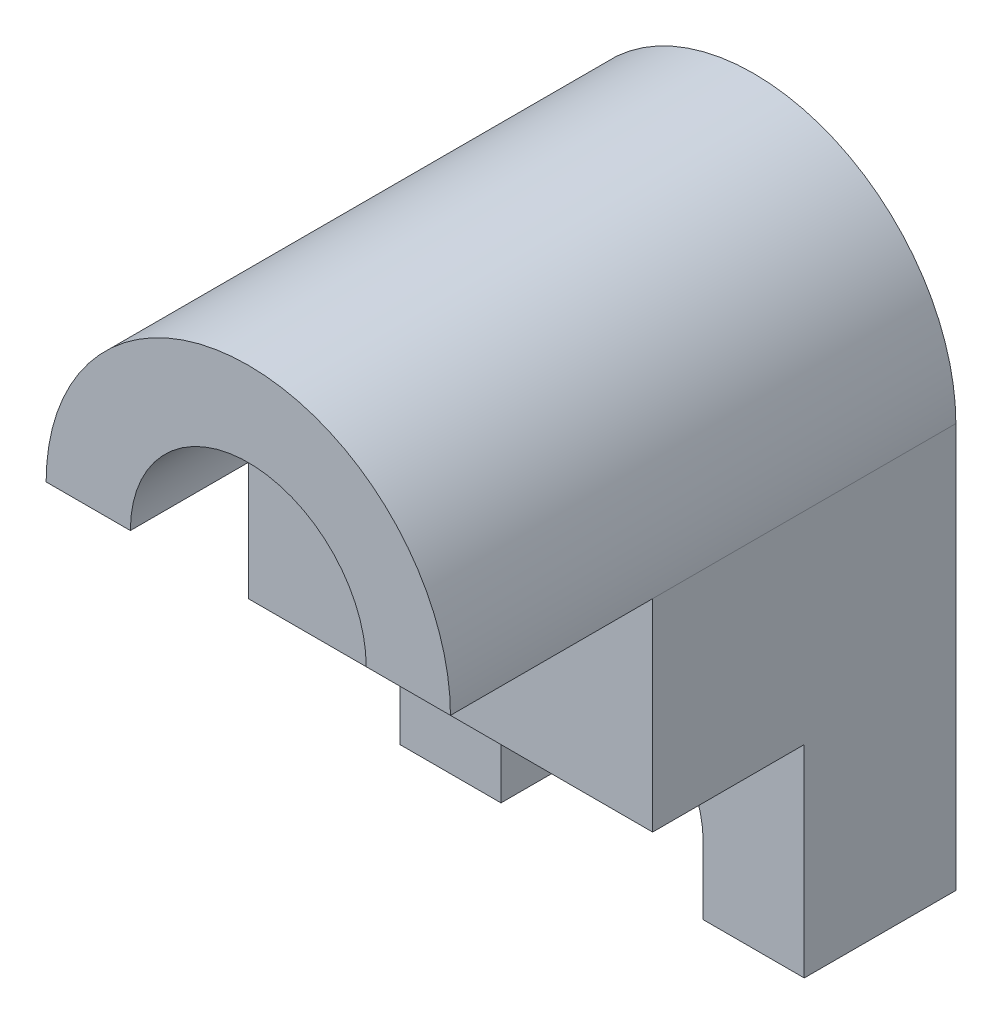
ISO-10303-21;
HEADER;
FILE_DESCRIPTION(('STEP AP214'),'2;1');
FILE_NAME('part.step','',(''),(''),'','','');
FILE_SCHEMA(('AUTOMOTIVE_DESIGN { 1 0 10303 214 1 1 1 1 }'));
ENDSEC;
DATA;
#1=APPLICATION_CONTEXT('core data for automotive mechanical design processes');
#2=APPLICATION_PROTOCOL_DEFINITION('international standard','automotive_design',2000,#1);
#3=PRODUCT_CONTEXT('',#1,'mechanical');
#4=PRODUCT('Part','Part','',(#3));
#5=PRODUCT_RELATED_PRODUCT_CATEGORY('part','',(#4));
#6=PRODUCT_DEFINITION_FORMATION('','',#4);
#7=PRODUCT_DEFINITION_CONTEXT('part definition',#1,'design');
#8=PRODUCT_DEFINITION('design','',#6,#7);
#9=PRODUCT_DEFINITION_SHAPE('','',#8);
#10=(LENGTH_UNIT() NAMED_UNIT(*) SI_UNIT(.MILLI.,.METRE.));
#11=(NAMED_UNIT(*) PLANE_ANGLE_UNIT() SI_UNIT($,.RADIAN.));
#12=(NAMED_UNIT(*) SI_UNIT($,.STERADIAN.) SOLID_ANGLE_UNIT());
#13=UNCERTAINTY_MEASURE_WITH_UNIT(LENGTH_MEASURE(1.E-05),#10,'distance_accuracy_value','');
#14=(GEOMETRIC_REPRESENTATION_CONTEXT(3) GLOBAL_UNCERTAINTY_ASSIGNED_CONTEXT((#13)) GLOBAL_UNIT_ASSIGNED_CONTEXT((#10,
#11,#12)) REPRESENTATION_CONTEXT('',''));
#15=CARTESIAN_POINT('',(0.,0.,0.));
#16=DIRECTION('',(0.,0.,1.));
#17=DIRECTION('',(1.,0.,0.));
#18=AXIS2_PLACEMENT_3D('',#15,#16,#17);
#19=CARTESIAN_POINT('',(0.,-3.99619744058501,15.));
#20=DIRECTION('',(0.,0.,-1.));
#21=DIRECTION('',(-1.,0.,0.));
#22=AXIS2_PLACEMENT_3D('',#19,#20,#21);
#23=CYLINDRICAL_SURFACE('',#22,3.);
#24=CARTESIAN_POINT('',(0.,-3.99619744058501,4.5));
#25=DIRECTION('',(0.,0.,-1.));
#26=DIRECTION('',(-1.,0.,0.));
#27=AXIS2_PLACEMENT_3D('',#24,#25,#26);
#28=CIRCLE('',#27,3.);
#29=CARTESIAN_POINT('',(-3.,-3.99619744058501,4.5));
#30=VERTEX_POINT('',#29);
#31=CARTESIAN_POINT('',(3.,-3.99619744058501,4.5));
#32=VERTEX_POINT('',#31);
#33=EDGE_CURVE('E210',#30,#32,#28,.T.);
#34=ORIENTED_EDGE('',*,*,#33,.F.);
#35=DIRECTION('',(0.,0.,-1.));
#36=VECTOR('',#35,1.);
#37=CARTESIAN_POINT('',(-3.,-3.99619744058501,15.));
#38=LINE('',#37,#36);
#39=CARTESIAN_POINT('',(-3.,-3.99619744058501,0.));
#40=VERTEX_POINT('',#39);
#41=EDGE_CURVE('E57',#30,#40,#38,.T.);
#42=ORIENTED_EDGE('',*,*,#41,.T.);
#43=CARTESIAN_POINT('',(0.,-3.99619744058501,0.));
#44=DIRECTION('',(0.,0.,1.));
#45=DIRECTION('',(1.,0.,0.));
#46=AXIS2_PLACEMENT_3D('',#43,#44,#45);
#47=CIRCLE('',#46,3.);
#48=CARTESIAN_POINT('',(3.,-3.99619744058501,0.));
#49=VERTEX_POINT('',#48);
#50=EDGE_CURVE('E165',#49,#40,#47,.T.);
#51=ORIENTED_EDGE('',*,*,#50,.F.);
#52=DIRECTION('',(0.,0.,-1.));
#53=VECTOR('',#52,1.);
#54=CARTESIAN_POINT('',(3.,-3.99619744058501,15.));
#55=LINE('',#54,#53);
#56=EDGE_CURVE('E140',#32,#49,#55,.T.);
#57=ORIENTED_EDGE('',*,*,#56,.F.);
#58=EDGE_LOOP('',(#34,#42,#51,#57));
#59=FACE_BOUND('',#58,.T.);
#60=ADVANCED_FACE('F35',(#59),#23,.F.);
#61=CARTESIAN_POINT('',(3.,0.,15.));
#62=DIRECTION('',(-1.,0.,0.));
#63=DIRECTION('',(0.,0.,1.));
#64=AXIS2_PLACEMENT_3D('',#61,#62,#63);
#65=PLANE('',#64);
#66=DIRECTION('',(0.,-1.,0.));
#67=VECTOR('',#66,1.);
#68=CARTESIAN_POINT('',(3.,0.,4.5));
#69=LINE('',#68,#67);
#70=CARTESIAN_POINT('',(3.,-6.,4.5));
#71=VERTEX_POINT('',#70);
#72=EDGE_CURVE('E217',#32,#71,#69,.T.);
#73=ORIENTED_EDGE('',*,*,#72,.F.);
#74=ORIENTED_EDGE('',*,*,#56,.T.);
#75=DIRECTION('',(0.,1.,0.));
#76=VECTOR('',#75,1.);
#77=CARTESIAN_POINT('',(3.,0.,0.));
#78=LINE('',#77,#76);
#79=CARTESIAN_POINT('',(3.,-6.,0.));
#80=VERTEX_POINT('',#79);
#81=EDGE_CURVE('E168',#80,#49,#78,.T.);
#82=ORIENTED_EDGE('',*,*,#81,.F.);
#83=DIRECTION('',(0.,0.,-1.));
#84=VECTOR('',#83,1.);
#85=CARTESIAN_POINT('',(3.,-6.,15.));
#86=LINE('',#85,#84);
#87=EDGE_CURVE('E194',#71,#80,#86,.T.);
#88=ORIENTED_EDGE('',*,*,#87,.F.);
#89=EDGE_LOOP('',(#73,#74,#82,#88));
#90=FACE_BOUND('',#89,.T.);
#91=ADVANCED_FACE('F261',(#90),#65,.T.);
#92=CARTESIAN_POINT('',(0.,-6.,15.));
#93=DIRECTION('',(0.,1.,0.));
#94=DIRECTION('',(0.,0.,1.));
#95=AXIS2_PLACEMENT_3D('',#92,#93,#94);
#96=PLANE('',#95);
#97=DIRECTION('',(0.,0.,-1.));
#98=VECTOR('',#97,1.);
#99=CARTESIAN_POINT('',(6.,-6.,15.));
#100=LINE('',#99,#98);
#101=CARTESIAN_POINT('',(6.,-6.,4.5));
#102=VERTEX_POINT('',#101);
#103=CARTESIAN_POINT('',(6.,-6.,0.));
#104=VERTEX_POINT('',#103);
#105=EDGE_CURVE('E192',#102,#104,#100,.T.);
#106=ORIENTED_EDGE('',*,*,#105,.F.);
#107=DIRECTION('',(-1.,0.,0.));
#108=VECTOR('',#107,1.);
#109=CARTESIAN_POINT('',(9.,-6.,4.5));
#110=LINE('',#109,#108);
#111=EDGE_CURVE('E212',#102,#71,#110,.T.);
#112=ORIENTED_EDGE('',*,*,#111,.T.);
#113=ORIENTED_EDGE('',*,*,#87,.T.);
#114=DIRECTION('',(1.,0.,0.));
#115=VECTOR('',#114,1.);
#116=CARTESIAN_POINT('',(0.,-6.,0.));
#117=LINE('',#116,#115);
#118=EDGE_CURVE('E171',#80,#104,#117,.T.);
#119=ORIENTED_EDGE('',*,*,#118,.T.);
#120=EDGE_LOOP('',(#106,#112,#113,#119));
#121=FACE_BOUND('',#120,.T.);
#122=ADVANCED_FACE('F256',(#121),#96,.F.);
#123=CARTESIAN_POINT('',(6.,0.,15.));
#124=DIRECTION('',(-1.,0.,0.));
#125=DIRECTION('',(0.,0.,1.));
#126=AXIS2_PLACEMENT_3D('',#123,#124,#125);
#127=PLANE('',#126);
#128=DIRECTION('',(0.,0.,-1.));
#129=VECTOR('',#128,1.);
#130=CARTESIAN_POINT('',(6.,0.,15.));
#131=LINE('',#130,#129);
#132=CARTESIAN_POINT('',(6.,0.,9.));
#133=VERTEX_POINT('',#132);
#134=CARTESIAN_POINT('',(6.,0.,4.5));
#135=VERTEX_POINT('',#134);
#136=EDGE_CURVE('E162',#133,#135,#131,.T.);
#137=ORIENTED_EDGE('',*,*,#136,.T.);
#138=DIRECTION('',(0.,-1.,0.));
#139=VECTOR('',#138,1.);
#140=CARTESIAN_POINT('',(6.,0.,4.5));
#141=LINE('',#140,#139);
#142=EDGE_CURVE('E218',#135,#102,#141,.T.);
#143=ORIENTED_EDGE('',*,*,#142,.T.);
#144=ORIENTED_EDGE('',*,*,#105,.T.);
#145=DIRECTION('',(0.,1.,0.));
#146=VECTOR('',#145,1.);
#147=CARTESIAN_POINT('',(6.,0.,0.));
#148=LINE('',#147,#146);
#149=CARTESIAN_POINT('',(6.,6.,0.));
#150=VERTEX_POINT('',#149);
#151=EDGE_CURVE('E174',#104,#150,#148,.T.);
#152=ORIENTED_EDGE('',*,*,#151,.T.);
#153=DIRECTION('',(0.,0.,-1.));
#154=VECTOR('',#153,1.);
#155=CARTESIAN_POINT('',(6.,6.,15.));
#156=LINE('',#155,#154);
#157=CARTESIAN_POINT('',(6.,6.,9.));
#158=VERTEX_POINT('',#157);
#159=EDGE_CURVE('E150',#158,#150,#156,.T.);
#160=ORIENTED_EDGE('',*,*,#159,.F.);
#161=DIRECTION('',(0.,-1.,0.));
#162=VECTOR('',#161,1.);
#163=CARTESIAN_POINT('',(6.,0.,9.));
#164=LINE('',#163,#162);
#165=EDGE_CURVE('E207',#158,#133,#164,.T.);
#166=ORIENTED_EDGE('',*,*,#165,.T.);
#167=EDGE_LOOP('',(#137,#143,#144,#152,#160,#166));
#168=FACE_BOUND('',#167,.T.);
#169=ADVANCED_FACE('F223',(#168),#127,.F.);
#170=CARTESIAN_POINT('',(0.,6.,15.));
#171=DIRECTION('',(0.,0.,-1.));
#172=DIRECTION('',(-1.,0.,0.));
#173=AXIS2_PLACEMENT_3D('',#170,#171,#172);
#174=CYLINDRICAL_SURFACE('',#173,6.);
#175=CARTESIAN_POINT('',(0.,6.,0.));
#176=DIRECTION('',(0.,0.,1.));
#177=DIRECTION('',(1.,0.,0.));
#178=AXIS2_PLACEMENT_3D('',#175,#176,#177);
#179=CIRCLE('',#178,6.);
#180=CARTESIAN_POINT('',(-6.,6.,0.));
#181=VERTEX_POINT('',#180);
#182=EDGE_CURVE('E178',#181,#150,#179,.F.);
#183=ORIENTED_EDGE('',*,*,#182,.F.);
#184=DIRECTION('',(0.,0.,-1.));
#185=VECTOR('',#184,1.);
#186=CARTESIAN_POINT('',(-6.,6.,15.));
#187=LINE('',#186,#185);
#188=CARTESIAN_POINT('',(-6.,6.,9.));
#189=VERTEX_POINT('',#188);
#190=EDGE_CURVE('E149',#189,#181,#187,.T.);
#191=ORIENTED_EDGE('',*,*,#190,.F.);
#192=CARTESIAN_POINT('',(-6.,6.,15.));
#193=VERTEX_POINT('',#192);
#194=EDGE_CURVE('E133',#193,#189,#187,.T.);
#195=ORIENTED_EDGE('',*,*,#194,.F.);
#196=CARTESIAN_POINT('',(0.,6.,15.));
#197=DIRECTION('',(0.,0.,1.));
#198=DIRECTION('',(1.,0.,0.));
#199=AXIS2_PLACEMENT_3D('',#196,#197,#198);
#200=CIRCLE('',#199,6.);
#201=CARTESIAN_POINT('',(6.,6.,15.));
#202=VERTEX_POINT('',#201);
#203=EDGE_CURVE('E148',#193,#202,#200,.F.);
#204=ORIENTED_EDGE('',*,*,#203,.T.);
#205=EDGE_CURVE('E190',#202,#158,#156,.T.);
#206=ORIENTED_EDGE('',*,*,#205,.T.);
#207=ORIENTED_EDGE('',*,*,#159,.T.);
#208=EDGE_LOOP('',(#183,#191,#195,#204,#206,#207));
#209=FACE_BOUND('',#208,.T.);
#210=ADVANCED_FACE('F146',(#209),#174,.T.);
#211=CARTESIAN_POINT('',(-6.,0.,15.));
#212=DIRECTION('',(-1.,0.,0.));
#213=DIRECTION('',(0.,0.,1.));
#214=AXIS2_PLACEMENT_3D('',#211,#212,#213);
#215=PLANE('',#214);
#216=DIRECTION('',(0.,-1.,0.));
#217=VECTOR('',#216,1.);
#218=CARTESIAN_POINT('',(-6.,-6.,4.5));
#219=LINE('',#218,#217);
#220=CARTESIAN_POINT('',(-6.,0.,4.5));
#221=VERTEX_POINT('',#220);
#222=CARTESIAN_POINT('',(-6.,-6.,4.5));
#223=VERTEX_POINT('',#222);
#224=EDGE_CURVE('E242',#221,#223,#219,.T.);
#225=ORIENTED_EDGE('',*,*,#224,.F.);
#226=DIRECTION('',(0.,0.,-1.));
#227=VECTOR('',#226,1.);
#228=CARTESIAN_POINT('',(-6.,0.,4.5));
#229=LINE('',#228,#227);
#230=CARTESIAN_POINT('',(-6.,0.,9.));
#231=VERTEX_POINT('',#230);
#232=EDGE_CURVE('E243',#231,#221,#229,.T.);
#233=ORIENTED_EDGE('',*,*,#232,.F.);
#234=DIRECTION('',(0.,-1.,0.));
#235=VECTOR('',#234,1.);
#236=CARTESIAN_POINT('',(-6.,0.,9.));
#237=LINE('',#236,#235);
#238=EDGE_CURVE('E234',#189,#231,#237,.T.);
#239=ORIENTED_EDGE('',*,*,#238,.F.);
#240=ORIENTED_EDGE('',*,*,#190,.T.);
#241=DIRECTION('',(0.,1.,0.));
#242=VECTOR('',#241,1.);
#243=CARTESIAN_POINT('',(-6.,0.,0.));
#244=LINE('',#243,#242);
#245=CARTESIAN_POINT('',(-6.,-6.,0.));
#246=VERTEX_POINT('',#245);
#247=EDGE_CURVE('E181',#246,#181,#244,.T.);
#248=ORIENTED_EDGE('',*,*,#247,.F.);
#249=DIRECTION('',(0.,0.,-1.));
#250=VECTOR('',#249,1.);
#251=CARTESIAN_POINT('',(-6.,-6.,15.));
#252=LINE('',#251,#250);
#253=EDGE_CURVE('E188',#223,#246,#252,.T.);
#254=ORIENTED_EDGE('',*,*,#253,.F.);
#255=EDGE_LOOP('',(#225,#233,#239,#240,#248,#254));
#256=FACE_BOUND('',#255,.T.);
#257=ADVANCED_FACE('F272',(#256),#215,.T.);
#258=DIRECTION('',(0.,0.,-1.));
#259=VECTOR('',#258,1.);
#260=CARTESIAN_POINT('',(-3.,-6.,15.));
#261=LINE('',#260,#259);
#262=CARTESIAN_POINT('',(-3.,-6.,4.5));
#263=VERTEX_POINT('',#262);
#264=CARTESIAN_POINT('',(-3.,-6.,0.));
#265=VERTEX_POINT('',#264);
#266=EDGE_CURVE('E186',#263,#265,#261,.T.);
#267=ORIENTED_EDGE('',*,*,#266,.F.);
#268=EDGE_CURVE('E238',#263,#223,#110,.T.);
#269=ORIENTED_EDGE('',*,*,#268,.T.);
#270=ORIENTED_EDGE('',*,*,#253,.T.);
#271=EDGE_CURVE('E175',#246,#265,#117,.T.);
#272=ORIENTED_EDGE('',*,*,#271,.T.);
#273=EDGE_LOOP('',(#267,#269,#270,#272));
#274=FACE_BOUND('',#273,.T.);
#275=ADVANCED_FACE('F273',(#274),#96,.F.);
#276=CARTESIAN_POINT('',(-3.,0.,15.));
#277=DIRECTION('',(-1.,0.,0.));
#278=DIRECTION('',(0.,0.,1.));
#279=AXIS2_PLACEMENT_3D('',#276,#277,#278);
#280=PLANE('',#279);
#281=ORIENTED_EDGE('',*,*,#41,.F.);
#282=DIRECTION('',(0.,-1.,0.));
#283=VECTOR('',#282,1.);
#284=CARTESIAN_POINT('',(-3.,0.,4.5));
#285=LINE('',#284,#283);
#286=EDGE_CURVE('E11',#30,#263,#285,.T.);
#287=ORIENTED_EDGE('',*,*,#286,.T.);
#288=ORIENTED_EDGE('',*,*,#266,.T.);
#289=DIRECTION('',(0.,1.,0.));
#290=VECTOR('',#289,1.);
#291=CARTESIAN_POINT('',(-3.,0.,0.));
#292=LINE('',#291,#290);
#293=EDGE_CURVE('E159',#265,#40,#292,.T.);
#294=ORIENTED_EDGE('',*,*,#293,.T.);
#295=EDGE_LOOP('',(#281,#287,#288,#294));
#296=FACE_BOUND('',#295,.T.);
#297=ADVANCED_FACE('F275',(#296),#280,.F.);
#298=CARTESIAN_POINT('',(0.,6.,15.));
#299=DIRECTION('',(0.,0.,-1.));
#300=DIRECTION('',(-1.,0.,0.));
#301=AXIS2_PLACEMENT_3D('',#298,#299,#300);
#302=CYLINDRICAL_SURFACE('',#301,3.5);
#303=DIRECTION('',(0.,0.,-1.));
#304=VECTOR('',#303,1.);
#305=CARTESIAN_POINT('',(3.5,6.,15.));
#306=LINE('',#305,#304);
#307=CARTESIAN_POINT('',(3.5,6.,15.));
#308=VERTEX_POINT('',#307);
#309=CARTESIAN_POINT('',(3.5,6.,9.));
#310=VERTEX_POINT('',#309);
#311=EDGE_CURVE('E203',#308,#310,#306,.T.);
#312=ORIENTED_EDGE('',*,*,#311,.F.);
#313=CARTESIAN_POINT('',(0.,6.,15.));
#314=DIRECTION('',(0.,0.,1.));
#315=DIRECTION('',(1.,0.,0.));
#316=AXIS2_PLACEMENT_3D('',#313,#314,#315);
#317=CIRCLE('',#316,3.5);
#318=CARTESIAN_POINT('',(-3.5,6.,15.));
#319=VERTEX_POINT('',#318);
#320=EDGE_CURVE('E154',#308,#319,#317,.T.);
#321=ORIENTED_EDGE('',*,*,#320,.T.);
#322=DIRECTION('',(0.,0.,-1.));
#323=VECTOR('',#322,1.);
#324=CARTESIAN_POINT('',(-3.5,6.,15.));
#325=LINE('',#324,#323);
#326=CARTESIAN_POINT('',(-3.5,6.,9.));
#327=VERTEX_POINT('',#326);
#328=EDGE_CURVE('E49',#327,#319,#325,.F.);
#329=ORIENTED_EDGE('',*,*,#328,.F.);
#330=CARTESIAN_POINT('',(0.,6.,9.));
#331=DIRECTION('',(0.,0.,-1.));
#332=DIRECTION('',(-1.,0.,0.));
#333=AXIS2_PLACEMENT_3D('',#330,#331,#332);
#334=CIRCLE('',#333,3.5);
#335=EDGE_CURVE('E42',#310,#327,#334,.T.);
#336=ORIENTED_EDGE('',*,*,#335,.F.);
#337=EDGE_LOOP('',(#312,#321,#329,#336));
#338=FACE_BOUND('',#337,.T.);
#339=CARTESIAN_POINT('',(0.,6.,0.));
#340=DIRECTION('',(0.,0.,1.));
#341=DIRECTION('',(1.,0.,0.));
#342=AXIS2_PLACEMENT_3D('',#339,#340,#341);
#343=CIRCLE('',#342,3.5);
#344=CARTESIAN_POINT('',(3.5,6.,0.));
#345=VERTEX_POINT('',#344);
#346=EDGE_CURVE('E155',#345,#345,#343,.T.);
#347=ORIENTED_EDGE('',*,*,#346,.F.);
#348=EDGE_LOOP('',(#347));
#349=FACE_BOUND('',#348,.T.);
#350=ADVANCED_FACE('F205',(#338,#349),#302,.F.);
#351=CARTESIAN_POINT('',(0.,0.,15.));
#352=DIRECTION('',(0.,0.,1.));
#353=DIRECTION('',(1.,0.,0.));
#354=AXIS2_PLACEMENT_3D('',#351,#352,#353);
#355=PLANE('',#354);
#356=DIRECTION('',(-1.,0.,0.));
#357=VECTOR('',#356,1.);
#358=CARTESIAN_POINT('',(0.,6.,15.));
#359=LINE('',#358,#357);
#360=EDGE_CURVE('E139',#202,#308,#359,.T.);
#361=ORIENTED_EDGE('',*,*,#360,.F.);
#362=ORIENTED_EDGE('',*,*,#203,.F.);
#363=EDGE_CURVE('E130',#319,#193,#359,.T.);
#364=ORIENTED_EDGE('',*,*,#363,.F.);
#365=ORIENTED_EDGE('',*,*,#320,.F.);
#366=EDGE_LOOP('',(#361,#362,#364,#365));
#367=FACE_BOUND('',#366,.T.);
#368=ADVANCED_FACE('F153',(#367),#355,.T.);
#369=CARTESIAN_POINT('',(0.,0.,0.));
#370=DIRECTION('',(0.,0.,1.));
#371=DIRECTION('',(1.,0.,0.));
#372=AXIS2_PLACEMENT_3D('',#369,#370,#371);
#373=PLANE('',#372);
#374=ORIENTED_EDGE('',*,*,#50,.T.);
#375=ORIENTED_EDGE('',*,*,#293,.F.);
#376=ORIENTED_EDGE('',*,*,#271,.F.);
#377=ORIENTED_EDGE('',*,*,#247,.T.);
#378=ORIENTED_EDGE('',*,*,#182,.T.);
#379=ORIENTED_EDGE('',*,*,#151,.F.);
#380=ORIENTED_EDGE('',*,*,#118,.F.);
#381=ORIENTED_EDGE('',*,*,#81,.T.);
#382=EDGE_LOOP('',(#374,#375,#376,#377,#378,#379,#380,#381));
#383=FACE_BOUND('',#382,.T.);
#384=ORIENTED_EDGE('',*,*,#346,.T.);
#385=EDGE_LOOP('',(#384));
#386=FACE_BOUND('',#385,.T.);
#387=ADVANCED_FACE('F264',(#383,#386),#373,.F.);
#388=CARTESIAN_POINT('',(9.,0.,4.5));
#389=DIRECTION('',(0.,1.,0.));
#390=DIRECTION('',(0.,0.,1.));
#391=AXIS2_PLACEMENT_3D('',#388,#389,#390);
#392=PLANE('',#391);
#393=DIRECTION('',(-1.,0.,0.));
#394=VECTOR('',#393,1.);
#395=CARTESIAN_POINT('',(9.,0.,9.));
#396=LINE('',#395,#394);
#397=EDGE_CURVE('E230',#133,#231,#396,.T.);
#398=ORIENTED_EDGE('',*,*,#397,.T.);
#399=ORIENTED_EDGE('',*,*,#232,.T.);
#400=DIRECTION('',(-1.,0.,0.));
#401=VECTOR('',#400,1.);
#402=CARTESIAN_POINT('',(9.,0.,4.5));
#403=LINE('',#402,#401);
#404=EDGE_CURVE('E232',#135,#221,#403,.T.);
#405=ORIENTED_EDGE('',*,*,#404,.F.);
#406=ORIENTED_EDGE('',*,*,#136,.F.);
#407=EDGE_LOOP('',(#398,#399,#405,#406));
#408=FACE_BOUND('',#407,.T.);
#409=ADVANCED_FACE('F228',(#408),#392,.F.);
#410=CARTESIAN_POINT('',(9.,-6.,4.5));
#411=DIRECTION('',(0.,0.,-1.));
#412=DIRECTION('',(-1.,0.,0.));
#413=AXIS2_PLACEMENT_3D('',#410,#411,#412);
#414=PLANE('',#413);
#415=ORIENTED_EDGE('',*,*,#404,.T.);
#416=ORIENTED_EDGE('',*,*,#224,.T.);
#417=ORIENTED_EDGE('',*,*,#268,.F.);
#418=ORIENTED_EDGE('',*,*,#286,.F.);
#419=ORIENTED_EDGE('',*,*,#33,.T.);
#420=ORIENTED_EDGE('',*,*,#72,.T.);
#421=ORIENTED_EDGE('',*,*,#111,.F.);
#422=ORIENTED_EDGE('',*,*,#142,.F.);
#423=EDGE_LOOP('',(#415,#416,#417,#418,#419,#420,#421,#422));
#424=FACE_BOUND('',#423,.T.);
#425=ADVANCED_FACE('F276',(#424),#414,.F.);
#426=CARTESIAN_POINT('',(9.,0.,9.));
#427=DIRECTION('',(0.,0.,-1.));
#428=DIRECTION('',(-1.,0.,0.));
#429=AXIS2_PLACEMENT_3D('',#426,#427,#428);
#430=PLANE('',#429);
#431=DIRECTION('',(-1.,0.,0.));
#432=VECTOR('',#431,1.);
#433=CARTESIAN_POINT('',(9.,6.,9.));
#434=LINE('',#433,#432);
#435=EDGE_CURVE('E236',#158,#310,#434,.T.);
#436=ORIENTED_EDGE('',*,*,#435,.T.);
#437=ORIENTED_EDGE('',*,*,#335,.T.);
#438=EDGE_CURVE('E240',#327,#189,#434,.T.);
#439=ORIENTED_EDGE('',*,*,#438,.T.);
#440=ORIENTED_EDGE('',*,*,#238,.T.);
#441=ORIENTED_EDGE('',*,*,#397,.F.);
#442=ORIENTED_EDGE('',*,*,#165,.F.);
#443=EDGE_LOOP('',(#436,#437,#439,#440,#441,#442));
#444=FACE_BOUND('',#443,.T.);
#445=ADVANCED_FACE('F233',(#444),#430,.F.);
#446=CARTESIAN_POINT('',(9.,6.,9.));
#447=DIRECTION('',(0.,1.,0.));
#448=DIRECTION('',(0.,0.,1.));
#449=AXIS2_PLACEMENT_3D('',#446,#447,#448);
#450=PLANE('',#449);
#451=ORIENTED_EDGE('',*,*,#205,.F.);
#452=ORIENTED_EDGE('',*,*,#360,.T.);
#453=ORIENTED_EDGE('',*,*,#311,.T.);
#454=ORIENTED_EDGE('',*,*,#435,.F.);
#455=EDGE_LOOP('',(#451,#452,#453,#454));
#456=FACE_BOUND('',#455,.T.);
#457=ADVANCED_FACE('F201',(#456),#450,.F.);
#458=ORIENTED_EDGE('',*,*,#328,.T.);
#459=ORIENTED_EDGE('',*,*,#363,.T.);
#460=ORIENTED_EDGE('',*,*,#194,.T.);
#461=ORIENTED_EDGE('',*,*,#438,.F.);
#462=EDGE_LOOP('',(#458,#459,#460,#461));
#463=FACE_BOUND('',#462,.T.);
#464=ADVANCED_FACE('F132',(#463),#450,.F.);
#465=CLOSED_SHELL('',(#60,#91,#122,#169,#210,#257,#275,#297,#350,#368,#387,#409,#425,#445,#457,#464));
#466=MANIFOLD_SOLID_BREP('B2',#465);
#467=ADVANCED_BREP_SHAPE_REPRESENTATION('',(#18,#466),#14);
#468=SHAPE_DEFINITION_REPRESENTATION(#9,#467);
ENDSEC;
END-ISO-10303-21;
